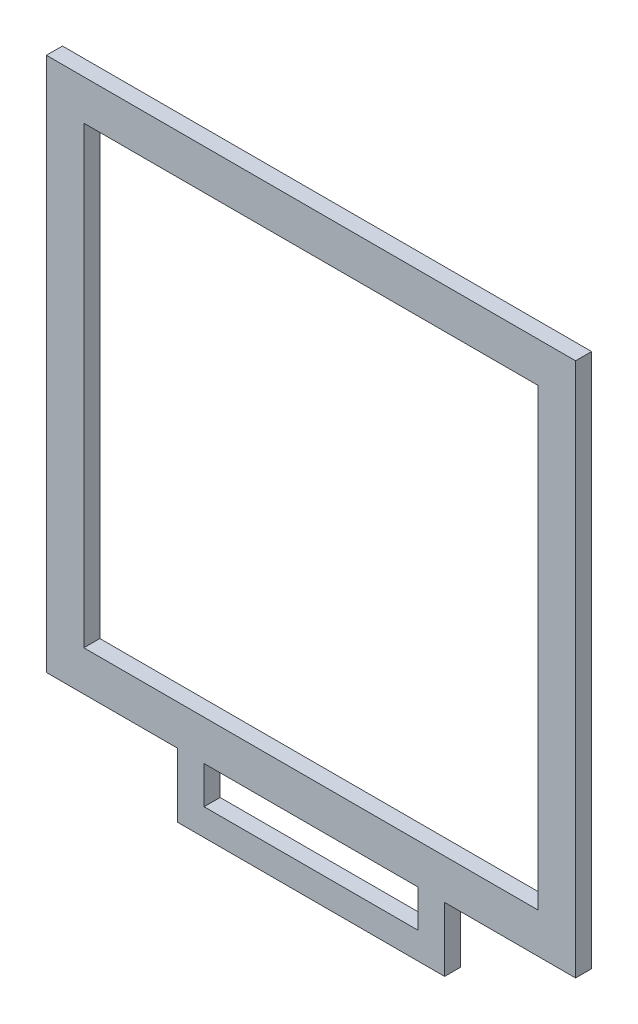
ISO-10303-21;
HEADER;
FILE_DESCRIPTION(('STEP AP214'),'2;1');
FILE_NAME('part.step','',(''),(''),'','','');
FILE_SCHEMA(('AUTOMOTIVE_DESIGN { 1 0 10303 214 1 1 1 1 }'));
ENDSEC;
DATA;
#1=APPLICATION_CONTEXT('core data for automotive mechanical design processes');
#2=APPLICATION_PROTOCOL_DEFINITION('international standard','automotive_design',2000,#1);
#3=PRODUCT_CONTEXT('',#1,'mechanical');
#4=PRODUCT('Part','Part','',(#3));
#5=PRODUCT_RELATED_PRODUCT_CATEGORY('part','',(#4));
#6=PRODUCT_DEFINITION_FORMATION('','',#4);
#7=PRODUCT_DEFINITION_CONTEXT('part definition',#1,'design');
#8=PRODUCT_DEFINITION('design','',#6,#7);
#9=PRODUCT_DEFINITION_SHAPE('','',#8);
#10=(LENGTH_UNIT() NAMED_UNIT(*) SI_UNIT(.MILLI.,.METRE.));
#11=(NAMED_UNIT(*) PLANE_ANGLE_UNIT() SI_UNIT($,.RADIAN.));
#12=(NAMED_UNIT(*) SI_UNIT($,.STERADIAN.) SOLID_ANGLE_UNIT());
#13=UNCERTAINTY_MEASURE_WITH_UNIT(LENGTH_MEASURE(1.E-05),#10,'distance_accuracy_value','');
#14=(GEOMETRIC_REPRESENTATION_CONTEXT(3) GLOBAL_UNCERTAINTY_ASSIGNED_CONTEXT((#13)) GLOBAL_UNIT_ASSIGNED_CONTEXT((#10,
#11,#12)) REPRESENTATION_CONTEXT('',''));
#15=CARTESIAN_POINT('',(0.,0.,0.));
#16=DIRECTION('',(0.,0.,1.));
#17=DIRECTION('',(1.,0.,0.));
#18=AXIS2_PLACEMENT_3D('',#15,#16,#17);
#19=CARTESIAN_POINT('',(0.,0.,3.));
#20=DIRECTION('',(0.,1.,0.));
#21=DIRECTION('',(0.,0.,1.));
#22=AXIS2_PLACEMENT_3D('',#19,#20,#21);
#23=PLANE('',#22);
#24=DIRECTION('',(1.,0.,0.));
#25=VECTOR('',#24,1.);
#26=CARTESIAN_POINT('',(0.,0.,0.));
#27=LINE('',#26,#25);
#28=CARTESIAN_POINT('',(0.,0.,0.));
#29=VERTEX_POINT('',#28);
#30=CARTESIAN_POINT('',(24.5,0.,0.));
#31=VERTEX_POINT('',#30);
#32=EDGE_CURVE('E256',#29,#31,#27,.T.);
#33=ORIENTED_EDGE('',*,*,#32,.T.);
#34=DIRECTION('',(0.,0.,1.));
#35=VECTOR('',#34,1.);
#36=CARTESIAN_POINT('',(24.5,0.,0.));
#37=LINE('',#36,#35);
#38=CARTESIAN_POINT('',(24.5,0.,3.));
#39=VERTEX_POINT('',#38);
#40=EDGE_CURVE('E173',#31,#39,#37,.T.);
#41=ORIENTED_EDGE('',*,*,#40,.T.);
#42=DIRECTION('',(1.,0.,0.));
#43=VECTOR('',#42,1.);
#44=CARTESIAN_POINT('',(0.,0.,3.));
#45=LINE('',#44,#43);
#46=CARTESIAN_POINT('',(0.,0.,3.));
#47=VERTEX_POINT('',#46);
#48=EDGE_CURVE('E244',#47,#39,#45,.T.);
#49=ORIENTED_EDGE('',*,*,#48,.F.);
#50=DIRECTION('',(0.,0.,-1.));
#51=VECTOR('',#50,1.);
#52=CARTESIAN_POINT('',(0.,0.,3.));
#53=LINE('',#52,#51);
#54=EDGE_CURVE('E11',#47,#29,#53,.T.);
#55=ORIENTED_EDGE('',*,*,#54,.T.);
#56=EDGE_LOOP('',(#33,#41,#49,#55));
#57=FACE_BOUND('',#56,.T.);
#58=ADVANCED_FACE('F33',(#57),#23,.F.);
#59=CARTESIAN_POINT('',(29.5,0.,3.));
#60=VERTEX_POINT('',#59);
#61=CARTESIAN_POINT('',(69.5,0.,3.));
#62=VERTEX_POINT('',#61);
#63=EDGE_CURVE('E248',#60,#62,#45,.T.);
#64=ORIENTED_EDGE('',*,*,#63,.F.);
#65=DIRECTION('',(0.,0.,1.));
#66=VECTOR('',#65,1.);
#67=CARTESIAN_POINT('',(29.5,0.,0.));
#68=LINE('',#67,#66);
#69=CARTESIAN_POINT('',(29.5,0.,0.));
#70=VERTEX_POINT('',#69);
#71=EDGE_CURVE('E196',#70,#60,#68,.T.);
#72=ORIENTED_EDGE('',*,*,#71,.F.);
#73=CARTESIAN_POINT('',(69.5,0.,0.));
#74=VERTEX_POINT('',#73);
#75=EDGE_CURVE('E259',#70,#74,#27,.T.);
#76=ORIENTED_EDGE('',*,*,#75,.T.);
#77=DIRECTION('',(0.,0.,1.));
#78=VECTOR('',#77,1.);
#79=CARTESIAN_POINT('',(69.5,0.,0.));
#80=LINE('',#79,#78);
#81=EDGE_CURVE('E202',#74,#62,#80,.T.);
#82=ORIENTED_EDGE('',*,*,#81,.T.);
#83=EDGE_LOOP('',(#64,#72,#76,#82));
#84=FACE_BOUND('',#83,.T.);
#85=ADVANCED_FACE('F289',(#84),#23,.F.);
#86=CARTESIAN_POINT('',(0.,0.,3.));
#87=DIRECTION('',(0.,0.,1.));
#88=DIRECTION('',(1.,0.,0.));
#89=AXIS2_PLACEMENT_3D('',#86,#87,#88);
#90=PLANE('',#89);
#91=ORIENTED_EDGE('',*,*,#63,.T.);
#92=DIRECTION('',(0.,-1.,0.));
#93=VECTOR('',#92,1.);
#94=CARTESIAN_POINT('',(69.5,-7.,3.));
#95=LINE('',#94,#93);
#96=CARTESIAN_POINT('',(69.5,-7.,3.));
#97=VERTEX_POINT('',#96);
#98=EDGE_CURVE('E190',#62,#97,#95,.T.);
#99=ORIENTED_EDGE('',*,*,#98,.T.);
#100=DIRECTION('',(-1.,0.,0.));
#101=VECTOR('',#100,1.);
#102=CARTESIAN_POINT('',(29.5,-7.,3.));
#103=LINE('',#102,#101);
#104=CARTESIAN_POINT('',(29.5,-7.,3.));
#105=VERTEX_POINT('',#104);
#106=EDGE_CURVE('E175',#97,#105,#103,.T.);
#107=ORIENTED_EDGE('',*,*,#106,.T.);
#108=DIRECTION('',(0.,1.,0.));
#109=VECTOR('',#108,1.);
#110=CARTESIAN_POINT('',(29.5,0.,3.));
#111=LINE('',#110,#109);
#112=EDGE_CURVE('E56',#105,#60,#111,.T.);
#113=ORIENTED_EDGE('',*,*,#112,.T.);
#114=EDGE_LOOP('',(#91,#99,#107,#113));
#115=FACE_BOUND('',#114,.T.);
#116=DIRECTION('',(0.,-1.,0.));
#117=VECTOR('',#116,1.);
#118=CARTESIAN_POINT('',(0.,100.,3.));
#119=LINE('',#118,#117);
#120=CARTESIAN_POINT('',(0.,100.,3.));
#121=VERTEX_POINT('',#120);
#122=EDGE_CURVE('E239',#121,#47,#119,.T.);
#123=ORIENTED_EDGE('',*,*,#122,.T.);
#124=ORIENTED_EDGE('',*,*,#48,.T.);
#125=DIRECTION('',(0.,-1.,0.));
#126=VECTOR('',#125,1.);
#127=CARTESIAN_POINT('',(24.5,-12.,3.));
#128=LINE('',#127,#126);
#129=CARTESIAN_POINT('',(24.5,-12.,3.));
#130=VERTEX_POINT('',#129);
#131=EDGE_CURVE('E186',#39,#130,#128,.T.);
#132=ORIENTED_EDGE('',*,*,#131,.T.);
#133=DIRECTION('',(1.,0.,0.));
#134=VECTOR('',#133,1.);
#135=CARTESIAN_POINT('',(74.5,-12.,3.));
#136=LINE('',#135,#134);
#137=CARTESIAN_POINT('',(74.5,-12.,3.));
#138=VERTEX_POINT('',#137);
#139=EDGE_CURVE('E153',#130,#138,#136,.T.);
#140=ORIENTED_EDGE('',*,*,#139,.T.);
#141=DIRECTION('',(0.,1.,0.));
#142=VECTOR('',#141,1.);
#143=CARTESIAN_POINT('',(74.5,0.,3.));
#144=LINE('',#143,#142);
#145=CARTESIAN_POINT('',(74.5,0.,3.));
#146=VERTEX_POINT('',#145);
#147=EDGE_CURVE('E48',#138,#146,#144,.T.);
#148=ORIENTED_EDGE('',*,*,#147,.T.);
#149=CARTESIAN_POINT('',(99.,0.,3.));
#150=VERTEX_POINT('',#149);
#151=EDGE_CURVE('E242',#146,#150,#45,.T.);
#152=ORIENTED_EDGE('',*,*,#151,.T.);
#153=DIRECTION('',(0.,1.,0.));
#154=VECTOR('',#153,1.);
#155=CARTESIAN_POINT('',(99.,100.,3.));
#156=LINE('',#155,#154);
#157=CARTESIAN_POINT('',(99.,100.,3.));
#158=VERTEX_POINT('',#157);
#159=EDGE_CURVE('E247',#150,#158,#156,.T.);
#160=ORIENTED_EDGE('',*,*,#159,.T.);
#161=DIRECTION('',(-1.,0.,0.));
#162=VECTOR('',#161,1.);
#163=CARTESIAN_POINT('',(0.,100.,3.));
#164=LINE('',#163,#162);
#165=EDGE_CURVE('E250',#158,#121,#164,.T.);
#166=ORIENTED_EDGE('',*,*,#165,.T.);
#167=EDGE_LOOP('',(#123,#124,#132,#140,#148,#152,#160,#166));
#168=FACE_BOUND('',#167,.T.);
#169=DIRECTION('',(-1.,0.,0.));
#170=VECTOR('',#169,1.);
#171=CARTESIAN_POINT('',(6.99999999999999,92.5,3.));
#172=LINE('',#171,#170);
#173=CARTESIAN_POINT('',(92.,92.5,3.));
#174=VERTEX_POINT('',#173);
#175=CARTESIAN_POINT('',(6.99999999999999,92.5,3.));
#176=VERTEX_POINT('',#175);
#177=EDGE_CURVE('E210',#174,#176,#172,.T.);
#178=ORIENTED_EDGE('',*,*,#177,.F.);
#179=DIRECTION('',(0.,1.,0.));
#180=VECTOR('',#179,1.);
#181=CARTESIAN_POINT('',(92.,7.5,3.));
#182=LINE('',#181,#180);
#183=CARTESIAN_POINT('',(92.,7.5,3.));
#184=VERTEX_POINT('',#183);
#185=EDGE_CURVE('E208',#184,#174,#182,.T.);
#186=ORIENTED_EDGE('',*,*,#185,.F.);
#187=DIRECTION('',(1.,0.,0.));
#188=VECTOR('',#187,1.);
#189=CARTESIAN_POINT('',(6.99999999999999,7.5,3.));
#190=LINE('',#189,#188);
#191=CARTESIAN_POINT('',(6.99999999999999,7.5,3.));
#192=VERTEX_POINT('',#191);
#193=EDGE_CURVE('E216',#192,#184,#190,.T.);
#194=ORIENTED_EDGE('',*,*,#193,.F.);
#195=DIRECTION('',(0.,-1.,0.));
#196=VECTOR('',#195,1.);
#197=CARTESIAN_POINT('',(6.99999999999999,7.5,3.));
#198=LINE('',#197,#196);
#199=EDGE_CURVE('E213',#176,#192,#198,.T.);
#200=ORIENTED_EDGE('',*,*,#199,.F.);
#201=EDGE_LOOP('',(#178,#186,#194,#200));
#202=FACE_BOUND('',#201,.T.);
#203=ADVANCED_FACE('F283',(#115,#168,#202),#90,.T.);
#204=CARTESIAN_POINT('',(0.,0.,0.));
#205=DIRECTION('',(0.,0.,1.));
#206=DIRECTION('',(1.,0.,0.));
#207=AXIS2_PLACEMENT_3D('',#204,#205,#206);
#208=PLANE('',#207);
#209=DIRECTION('',(0.,-1.,0.));
#210=VECTOR('',#209,1.);
#211=CARTESIAN_POINT('',(69.5,-7.,0.));
#212=LINE('',#211,#210);
#213=CARTESIAN_POINT('',(69.5,-7.,0.));
#214=VERTEX_POINT('',#213);
#215=EDGE_CURVE('E179',#74,#214,#212,.T.);
#216=ORIENTED_EDGE('',*,*,#215,.F.);
#217=ORIENTED_EDGE('',*,*,#75,.F.);
#218=DIRECTION('',(0.,1.,0.));
#219=VECTOR('',#218,1.);
#220=CARTESIAN_POINT('',(29.5,0.,0.));
#221=LINE('',#220,#219);
#222=CARTESIAN_POINT('',(29.5,-7.,0.));
#223=VERTEX_POINT('',#222);
#224=EDGE_CURVE('E158',#223,#70,#221,.T.);
#225=ORIENTED_EDGE('',*,*,#224,.F.);
#226=DIRECTION('',(-1.,0.,0.));
#227=VECTOR('',#226,1.);
#228=CARTESIAN_POINT('',(29.5,-7.,0.));
#229=LINE('',#228,#227);
#230=EDGE_CURVE('E182',#214,#223,#229,.T.);
#231=ORIENTED_EDGE('',*,*,#230,.F.);
#232=EDGE_LOOP('',(#216,#217,#225,#231));
#233=FACE_BOUND('',#232,.T.);
#234=DIRECTION('',(0.,-1.,0.));
#235=VECTOR('',#234,1.);
#236=CARTESIAN_POINT('',(0.,100.,0.));
#237=LINE('',#236,#235);
#238=CARTESIAN_POINT('',(0.,100.,0.));
#239=VERTEX_POINT('',#238);
#240=EDGE_CURVE('E238',#239,#29,#237,.T.);
#241=ORIENTED_EDGE('',*,*,#240,.F.);
#242=DIRECTION('',(-1.,0.,0.));
#243=VECTOR('',#242,1.);
#244=CARTESIAN_POINT('',(0.,100.,0.));
#245=LINE('',#244,#243);
#246=CARTESIAN_POINT('',(99.,100.,0.));
#247=VERTEX_POINT('',#246);
#248=EDGE_CURVE('E243',#247,#239,#245,.T.);
#249=ORIENTED_EDGE('',*,*,#248,.F.);
#250=DIRECTION('',(0.,1.,0.));
#251=VECTOR('',#250,1.);
#252=CARTESIAN_POINT('',(99.,100.,0.));
#253=LINE('',#252,#251);
#254=CARTESIAN_POINT('',(99.,0.,0.));
#255=VERTEX_POINT('',#254);
#256=EDGE_CURVE('E258',#255,#247,#253,.T.);
#257=ORIENTED_EDGE('',*,*,#256,.F.);
#258=CARTESIAN_POINT('',(74.5,0.,0.));
#259=VERTEX_POINT('',#258);
#260=EDGE_CURVE('E255',#259,#255,#27,.T.);
#261=ORIENTED_EDGE('',*,*,#260,.F.);
#262=DIRECTION('',(0.,1.,0.));
#263=VECTOR('',#262,1.);
#264=CARTESIAN_POINT('',(74.5,0.,0.));
#265=LINE('',#264,#263);
#266=CARTESIAN_POINT('',(74.5,-12.,0.));
#267=VERTEX_POINT('',#266);
#268=EDGE_CURVE('E169',#267,#259,#265,.T.);
#269=ORIENTED_EDGE('',*,*,#268,.F.);
#270=DIRECTION('',(1.,0.,0.));
#271=VECTOR('',#270,1.);
#272=CARTESIAN_POINT('',(74.5,-12.,0.));
#273=LINE('',#272,#271);
#274=CARTESIAN_POINT('',(24.5,-12.,0.));
#275=VERTEX_POINT('',#274);
#276=EDGE_CURVE('E152',#275,#267,#273,.T.);
#277=ORIENTED_EDGE('',*,*,#276,.F.);
#278=DIRECTION('',(0.,-1.,0.));
#279=VECTOR('',#278,1.);
#280=CARTESIAN_POINT('',(24.5,-12.,0.));
#281=LINE('',#280,#279);
#282=EDGE_CURVE('E166',#31,#275,#281,.T.);
#283=ORIENTED_EDGE('',*,*,#282,.F.);
#284=ORIENTED_EDGE('',*,*,#32,.F.);
#285=EDGE_LOOP('',(#241,#249,#257,#261,#269,#277,#283,#284));
#286=FACE_BOUND('',#285,.T.);
#287=DIRECTION('',(0.,1.,0.));
#288=VECTOR('',#287,1.);
#289=CARTESIAN_POINT('',(92.,7.5,0.));
#290=LINE('',#289,#288);
#291=CARTESIAN_POINT('',(92.,7.5,0.));
#292=VERTEX_POINT('',#291);
#293=CARTESIAN_POINT('',(92.,92.5,0.));
#294=VERTEX_POINT('',#293);
#295=EDGE_CURVE('E195',#292,#294,#290,.T.);
#296=ORIENTED_EDGE('',*,*,#295,.T.);
#297=DIRECTION('',(-1.,0.,0.));
#298=VECTOR('',#297,1.);
#299=CARTESIAN_POINT('',(6.99999999999999,92.5,0.));
#300=LINE('',#299,#298);
#301=CARTESIAN_POINT('',(6.99999999999999,92.5,0.));
#302=VERTEX_POINT('',#301);
#303=EDGE_CURVE('E221',#294,#302,#300,.T.);
#304=ORIENTED_EDGE('',*,*,#303,.T.);
#305=DIRECTION('',(0.,-1.,0.));
#306=VECTOR('',#305,1.);
#307=CARTESIAN_POINT('',(6.99999999999999,7.5,0.));
#308=LINE('',#307,#306);
#309=CARTESIAN_POINT('',(6.99999999999999,7.5,0.));
#310=VERTEX_POINT('',#309);
#311=EDGE_CURVE('E224',#302,#310,#308,.T.);
#312=ORIENTED_EDGE('',*,*,#311,.T.);
#313=DIRECTION('',(1.,0.,0.));
#314=VECTOR('',#313,1.);
#315=CARTESIAN_POINT('',(6.99999999999999,7.5,0.));
#316=LINE('',#315,#314);
#317=EDGE_CURVE('E211',#310,#292,#316,.T.);
#318=ORIENTED_EDGE('',*,*,#317,.T.);
#319=EDGE_LOOP('',(#296,#304,#312,#318));
#320=FACE_BOUND('',#319,.T.);
#321=ADVANCED_FACE('F164',(#233,#286,#320),#208,.F.);
#322=CARTESIAN_POINT('',(0.,100.,3.));
#323=DIRECTION('',(1.,0.,0.));
#324=DIRECTION('',(0.,1.,0.));
#325=AXIS2_PLACEMENT_3D('',#322,#323,#324);
#326=PLANE('',#325);
#327=ORIENTED_EDGE('',*,*,#240,.T.);
#328=ORIENTED_EDGE('',*,*,#54,.F.);
#329=ORIENTED_EDGE('',*,*,#122,.F.);
#330=DIRECTION('',(0.,0.,-1.));
#331=VECTOR('',#330,1.);
#332=CARTESIAN_POINT('',(0.,100.,3.));
#333=LINE('',#332,#331);
#334=EDGE_CURVE('E252',#121,#239,#333,.T.);
#335=ORIENTED_EDGE('',*,*,#334,.T.);
#336=EDGE_LOOP('',(#327,#328,#329,#335));
#337=FACE_BOUND('',#336,.T.);
#338=ADVANCED_FACE('F35',(#337),#326,.F.);
#339=ORIENTED_EDGE('',*,*,#151,.F.);
#340=DIRECTION('',(0.,0.,1.));
#341=VECTOR('',#340,1.);
#342=CARTESIAN_POINT('',(74.5,0.,0.));
#343=LINE('',#342,#341);
#344=EDGE_CURVE('E205',#259,#146,#343,.T.);
#345=ORIENTED_EDGE('',*,*,#344,.F.);
#346=ORIENTED_EDGE('',*,*,#260,.T.);
#347=DIRECTION('',(0.,0.,-1.));
#348=VECTOR('',#347,1.);
#349=CARTESIAN_POINT('',(99.,0.,3.));
#350=LINE('',#349,#348);
#351=EDGE_CURVE('E41',#150,#255,#350,.T.);
#352=ORIENTED_EDGE('',*,*,#351,.F.);
#353=EDGE_LOOP('',(#339,#345,#346,#352));
#354=FACE_BOUND('',#353,.T.);
#355=ADVANCED_FACE('F314',(#354),#23,.F.);
#356=CARTESIAN_POINT('',(99.,100.,3.));
#357=DIRECTION('',(-1.,0.,0.));
#358=DIRECTION('',(0.,0.,1.));
#359=AXIS2_PLACEMENT_3D('',#356,#357,#358);
#360=PLANE('',#359);
#361=ORIENTED_EDGE('',*,*,#256,.T.);
#362=DIRECTION('',(0.,0.,-1.));
#363=VECTOR('',#362,1.);
#364=CARTESIAN_POINT('',(99.,100.,3.));
#365=LINE('',#364,#363);
#366=EDGE_CURVE('E264',#158,#247,#365,.T.);
#367=ORIENTED_EDGE('',*,*,#366,.F.);
#368=ORIENTED_EDGE('',*,*,#159,.F.);
#369=ORIENTED_EDGE('',*,*,#351,.T.);
#370=EDGE_LOOP('',(#361,#367,#368,#369));
#371=FACE_BOUND('',#370,.T.);
#372=ADVANCED_FACE('F271',(#371),#360,.F.);
#373=CARTESIAN_POINT('',(0.,100.,3.));
#374=DIRECTION('',(0.,-1.,0.));
#375=DIRECTION('',(0.,0.,-1.));
#376=AXIS2_PLACEMENT_3D('',#373,#374,#375);
#377=PLANE('',#376);
#378=ORIENTED_EDGE('',*,*,#248,.T.);
#379=ORIENTED_EDGE('',*,*,#334,.F.);
#380=ORIENTED_EDGE('',*,*,#165,.F.);
#381=ORIENTED_EDGE('',*,*,#366,.T.);
#382=EDGE_LOOP('',(#378,#379,#380,#381));
#383=FACE_BOUND('',#382,.T.);
#384=ADVANCED_FACE('F278',(#383),#377,.F.);
#385=CARTESIAN_POINT('',(92.,7.5,3.));
#386=DIRECTION('',(-1.,0.,0.));
#387=DIRECTION('',(0.,0.,1.));
#388=AXIS2_PLACEMENT_3D('',#385,#386,#387);
#389=PLANE('',#388);
#390=ORIENTED_EDGE('',*,*,#295,.F.);
#391=DIRECTION('',(0.,0.,-1.));
#392=VECTOR('',#391,1.);
#393=CARTESIAN_POINT('',(92.,7.5,3.));
#394=LINE('',#393,#392);
#395=EDGE_CURVE('E218',#184,#292,#394,.T.);
#396=ORIENTED_EDGE('',*,*,#395,.F.);
#397=ORIENTED_EDGE('',*,*,#185,.T.);
#398=DIRECTION('',(0.,0.,-1.));
#399=VECTOR('',#398,1.);
#400=CARTESIAN_POINT('',(92.,92.5,3.));
#401=LINE('',#400,#399);
#402=EDGE_CURVE('E235',#174,#294,#401,.T.);
#403=ORIENTED_EDGE('',*,*,#402,.T.);
#404=EDGE_LOOP('',(#390,#396,#397,#403));
#405=FACE_BOUND('',#404,.T.);
#406=ADVANCED_FACE('F335',(#405),#389,.T.);
#407=CARTESIAN_POINT('',(6.99999999999999,92.5,3.));
#408=DIRECTION('',(0.,-1.,0.));
#409=DIRECTION('',(0.,0.,-1.));
#410=AXIS2_PLACEMENT_3D('',#407,#408,#409);
#411=PLANE('',#410);
#412=ORIENTED_EDGE('',*,*,#303,.F.);
#413=ORIENTED_EDGE('',*,*,#402,.F.);
#414=ORIENTED_EDGE('',*,*,#177,.T.);
#415=DIRECTION('',(0.,0.,-1.));
#416=VECTOR('',#415,1.);
#417=CARTESIAN_POINT('',(6.99999999999999,92.5,3.));
#418=LINE('',#417,#416);
#419=EDGE_CURVE('E233',#176,#302,#418,.T.);
#420=ORIENTED_EDGE('',*,*,#419,.T.);
#421=EDGE_LOOP('',(#412,#413,#414,#420));
#422=FACE_BOUND('',#421,.T.);
#423=ADVANCED_FACE('F339',(#422),#411,.T.);
#424=CARTESIAN_POINT('',(6.99999999999999,7.5,3.));
#425=DIRECTION('',(1.,0.,0.));
#426=DIRECTION('',(0.,0.,-1.));
#427=AXIS2_PLACEMENT_3D('',#424,#425,#426);
#428=PLANE('',#427);
#429=ORIENTED_EDGE('',*,*,#311,.F.);
#430=ORIENTED_EDGE('',*,*,#419,.F.);
#431=ORIENTED_EDGE('',*,*,#199,.T.);
#432=DIRECTION('',(0.,0.,-1.));
#433=VECTOR('',#432,1.);
#434=CARTESIAN_POINT('',(6.99999999999999,7.5,3.));
#435=LINE('',#434,#433);
#436=EDGE_CURVE('E231',#192,#310,#435,.T.);
#437=ORIENTED_EDGE('',*,*,#436,.T.);
#438=EDGE_LOOP('',(#429,#430,#431,#437));
#439=FACE_BOUND('',#438,.T.);
#440=ADVANCED_FACE('F344',(#439),#428,.T.);
#441=CARTESIAN_POINT('',(6.99999999999999,7.5,3.));
#442=DIRECTION('',(0.,1.,0.));
#443=DIRECTION('',(0.,0.,1.));
#444=AXIS2_PLACEMENT_3D('',#441,#442,#443);
#445=PLANE('',#444);
#446=ORIENTED_EDGE('',*,*,#317,.F.);
#447=ORIENTED_EDGE('',*,*,#436,.F.);
#448=ORIENTED_EDGE('',*,*,#193,.T.);
#449=ORIENTED_EDGE('',*,*,#395,.T.);
#450=EDGE_LOOP('',(#446,#447,#448,#449));
#451=FACE_BOUND('',#450,.T.);
#452=ADVANCED_FACE('F310',(#451),#445,.T.);
#453=CARTESIAN_POINT('',(24.5,-12.,0.));
#454=DIRECTION('',(-1.,0.,0.));
#455=DIRECTION('',(0.,0.,1.));
#456=AXIS2_PLACEMENT_3D('',#453,#454,#455);
#457=PLANE('',#456);
#458=ORIENTED_EDGE('',*,*,#131,.F.);
#459=ORIENTED_EDGE('',*,*,#40,.F.);
#460=ORIENTED_EDGE('',*,*,#282,.T.);
#461=DIRECTION('',(0.,0.,1.));
#462=VECTOR('',#461,1.);
#463=CARTESIAN_POINT('',(24.5,-12.,0.));
#464=LINE('',#463,#462);
#465=EDGE_CURVE('E149',#275,#130,#464,.T.);
#466=ORIENTED_EDGE('',*,*,#465,.T.);
#467=EDGE_LOOP('',(#458,#459,#460,#466));
#468=FACE_BOUND('',#467,.T.);
#469=ADVANCED_FACE('F171',(#468),#457,.T.);
#470=CARTESIAN_POINT('',(29.5,0.,0.));
#471=DIRECTION('',(1.,0.,0.));
#472=DIRECTION('',(0.,0.,-1.));
#473=AXIS2_PLACEMENT_3D('',#470,#471,#472);
#474=PLANE('',#473);
#475=ORIENTED_EDGE('',*,*,#112,.F.);
#476=DIRECTION('',(0.,0.,1.));
#477=VECTOR('',#476,1.);
#478=CARTESIAN_POINT('',(29.5,-7.,0.));
#479=LINE('',#478,#477);
#480=EDGE_CURVE('E198',#223,#105,#479,.T.);
#481=ORIENTED_EDGE('',*,*,#480,.F.);
#482=ORIENTED_EDGE('',*,*,#224,.T.);
#483=ORIENTED_EDGE('',*,*,#71,.T.);
#484=EDGE_LOOP('',(#475,#481,#482,#483));
#485=FACE_BOUND('',#484,.T.);
#486=ADVANCED_FACE('F302',(#485),#474,.T.);
#487=CARTESIAN_POINT('',(29.5,-7.,0.));
#488=DIRECTION('',(0.,1.,0.));
#489=DIRECTION('',(0.,0.,1.));
#490=AXIS2_PLACEMENT_3D('',#487,#488,#489);
#491=PLANE('',#490);
#492=ORIENTED_EDGE('',*,*,#106,.F.);
#493=DIRECTION('',(0.,0.,1.));
#494=VECTOR('',#493,1.);
#495=CARTESIAN_POINT('',(69.5,-7.,0.));
#496=LINE('',#495,#494);
#497=EDGE_CURVE('E200',#214,#97,#496,.T.);
#498=ORIENTED_EDGE('',*,*,#497,.F.);
#499=ORIENTED_EDGE('',*,*,#230,.T.);
#500=ORIENTED_EDGE('',*,*,#480,.T.);
#501=EDGE_LOOP('',(#492,#498,#499,#500));
#502=FACE_BOUND('',#501,.T.);
#503=ADVANCED_FACE('F300',(#502),#491,.T.);
#504=CARTESIAN_POINT('',(69.5,-7.,0.));
#505=DIRECTION('',(-1.,0.,0.));
#506=DIRECTION('',(0.,0.,1.));
#507=AXIS2_PLACEMENT_3D('',#504,#505,#506);
#508=PLANE('',#507);
#509=ORIENTED_EDGE('',*,*,#98,.F.);
#510=ORIENTED_EDGE('',*,*,#81,.F.);
#511=ORIENTED_EDGE('',*,*,#215,.T.);
#512=ORIENTED_EDGE('',*,*,#497,.T.);
#513=EDGE_LOOP('',(#509,#510,#511,#512));
#514=FACE_BOUND('',#513,.T.);
#515=ADVANCED_FACE('F294',(#514),#508,.T.);
#516=CARTESIAN_POINT('',(74.5,0.,0.));
#517=DIRECTION('',(1.,0.,0.));
#518=DIRECTION('',(0.,0.,-1.));
#519=AXIS2_PLACEMENT_3D('',#516,#517,#518);
#520=PLANE('',#519);
#521=ORIENTED_EDGE('',*,*,#147,.F.);
#522=DIRECTION('',(0.,0.,1.));
#523=VECTOR('',#522,1.);
#524=CARTESIAN_POINT('',(74.5,-12.,0.));
#525=LINE('',#524,#523);
#526=EDGE_CURVE('E157',#267,#138,#525,.T.);
#527=ORIENTED_EDGE('',*,*,#526,.F.);
#528=ORIENTED_EDGE('',*,*,#268,.T.);
#529=ORIENTED_EDGE('',*,*,#344,.T.);
#530=EDGE_LOOP('',(#521,#527,#528,#529));
#531=FACE_BOUND('',#530,.T.);
#532=ADVANCED_FACE('F356',(#531),#520,.T.);
#533=CARTESIAN_POINT('',(74.5,-12.,0.));
#534=DIRECTION('',(0.,-1.,0.));
#535=DIRECTION('',(0.,0.,-1.));
#536=AXIS2_PLACEMENT_3D('',#533,#534,#535);
#537=PLANE('',#536);
#538=ORIENTED_EDGE('',*,*,#139,.F.);
#539=ORIENTED_EDGE('',*,*,#465,.F.);
#540=ORIENTED_EDGE('',*,*,#276,.T.);
#541=ORIENTED_EDGE('',*,*,#526,.T.);
#542=EDGE_LOOP('',(#538,#539,#540,#541));
#543=FACE_BOUND('',#542,.T.);
#544=ADVANCED_FACE('F151',(#543),#537,.T.);
#545=CLOSED_SHELL('',(#58,#85,#203,#321,#338,#355,#372,#384,#406,#423,#440,#452,#469,#486,#503,
#515,#532,#544));
#546=MANIFOLD_SOLID_BREP('B2',#545);
#547=ADVANCED_BREP_SHAPE_REPRESENTATION('',(#18,#546),#14);
#548=SHAPE_DEFINITION_REPRESENTATION(#9,#547);
ENDSEC;
END-ISO-10303-21;
